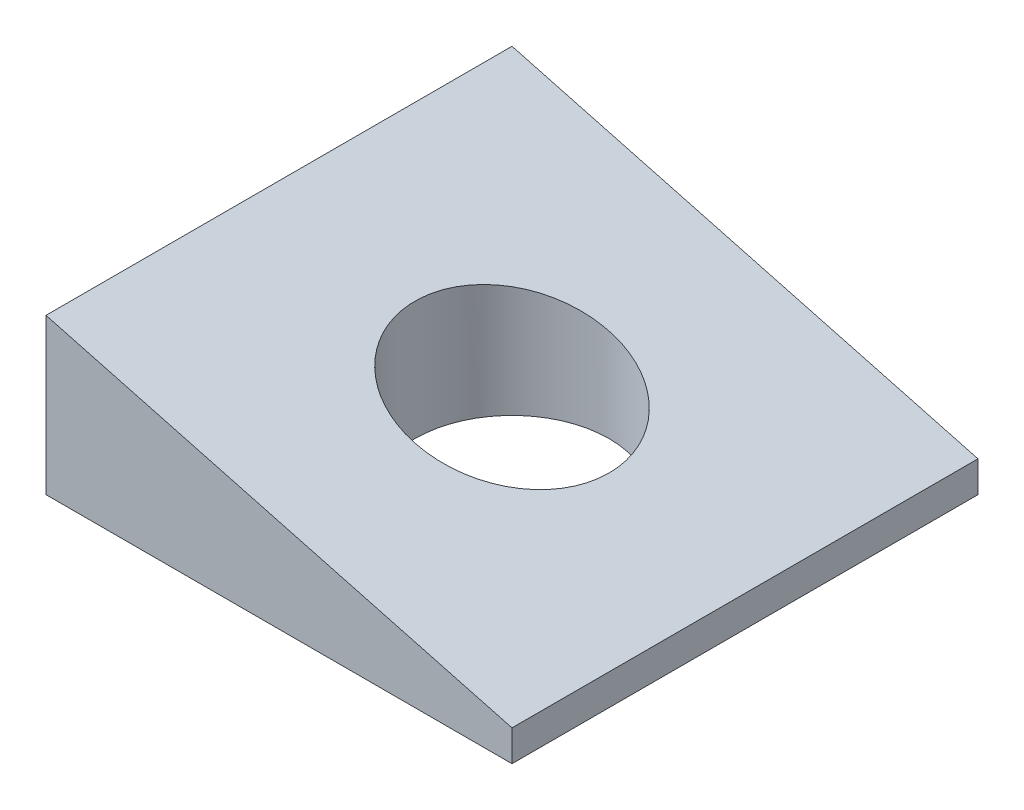
ISO-10303-21;
HEADER;
FILE_DESCRIPTION(('STEP AP214'),'2;1');
FILE_NAME('part.step','',(''),(''),'','','');
FILE_SCHEMA(('AUTOMOTIVE_DESIGN { 1 0 10303 214 1 1 1 1 }'));
ENDSEC;
DATA;
#1=APPLICATION_CONTEXT('core data for automotive mechanical design processes');
#2=APPLICATION_PROTOCOL_DEFINITION('international standard','automotive_design',2000,#1);
#3=PRODUCT_CONTEXT('',#1,'mechanical');
#4=PRODUCT('Part','Part','',(#3));
#5=PRODUCT_RELATED_PRODUCT_CATEGORY('part','',(#4));
#6=PRODUCT_DEFINITION_FORMATION('','',#4);
#7=PRODUCT_DEFINITION_CONTEXT('part definition',#1,'design');
#8=PRODUCT_DEFINITION('design','',#6,#7);
#9=PRODUCT_DEFINITION_SHAPE('','',#8);
#10=(LENGTH_UNIT() NAMED_UNIT(*) SI_UNIT(.MILLI.,.METRE.));
#11=(NAMED_UNIT(*) PLANE_ANGLE_UNIT() SI_UNIT($,.RADIAN.));
#12=(NAMED_UNIT(*) SI_UNIT($,.STERADIAN.) SOLID_ANGLE_UNIT());
#13=UNCERTAINTY_MEASURE_WITH_UNIT(LENGTH_MEASURE(1.E-05),#10,'distance_accuracy_value','');
#14=(GEOMETRIC_REPRESENTATION_CONTEXT(3) GLOBAL_UNCERTAINTY_ASSIGNED_CONTEXT((#13)) GLOBAL_UNIT_ASSIGNED_CONTEXT((#10,
#11,#12)) REPRESENTATION_CONTEXT('',''));
#15=CARTESIAN_POINT('',(0.,0.,0.));
#16=DIRECTION('',(0.,0.,1.));
#17=DIRECTION('',(1.,0.,0.));
#18=AXIS2_PLACEMENT_3D('',#15,#16,#17);
#19=CARTESIAN_POINT('',(38.1,0.,38.1));
#20=DIRECTION('',(0.,1.,0.));
#21=DIRECTION('',(-1.,0.,0.));
#22=AXIS2_PLACEMENT_3D('',#19,#20,#21);
#23=PLANE('',#22);
#24=CARTESIAN_POINT('',(19.05,0.,19.05));
#25=DIRECTION('',(0.,-1.,0.));
#26=DIRECTION('',(1.,0.,0.));
#27=AXIS2_PLACEMENT_3D('',#24,#25,#26);
#28=CIRCLE('',#27,7.9375);
#29=CARTESIAN_POINT('',(26.9875,0.,19.05));
#30=VERTEX_POINT('',#29);
#31=EDGE_CURVE('E159',#30,#30,#28,.T.);
#32=ORIENTED_EDGE('',*,*,#31,.F.);
#33=EDGE_LOOP('',(#32));
#34=FACE_BOUND('',#33,.T.);
#35=DIRECTION('',(1.,0.,0.));
#36=VECTOR('',#35,1.);
#37=CARTESIAN_POINT('',(38.1,0.,0.));
#38=LINE('',#37,#36);
#39=CARTESIAN_POINT('',(0.,0.,0.));
#40=VERTEX_POINT('',#39);
#41=CARTESIAN_POINT('',(38.1,0.,0.));
#42=VERTEX_POINT('',#41);
#43=EDGE_CURVE('E137',#40,#42,#38,.T.);
#44=ORIENTED_EDGE('',*,*,#43,.T.);
#45=DIRECTION('',(0.,0.,-1.));
#46=VECTOR('',#45,1.);
#47=CARTESIAN_POINT('',(38.1,0.,38.1));
#48=LINE('',#47,#46);
#49=CARTESIAN_POINT('',(38.1,0.,38.1));
#50=VERTEX_POINT('',#49);
#51=EDGE_CURVE('E13',#50,#42,#48,.T.);
#52=ORIENTED_EDGE('',*,*,#51,.F.);
#53=DIRECTION('',(1.,0.,0.));
#54=VECTOR('',#53,1.);
#55=CARTESIAN_POINT('',(38.1,0.,38.1));
#56=LINE('',#55,#54);
#57=CARTESIAN_POINT('',(0.,0.,38.1));
#58=VERTEX_POINT('',#57);
#59=EDGE_CURVE('E119',#58,#50,#56,.T.);
#60=ORIENTED_EDGE('',*,*,#59,.F.);
#61=DIRECTION('',(0.,0.,-1.));
#62=VECTOR('',#61,1.);
#63=CARTESIAN_POINT('',(0.,0.,38.1));
#64=LINE('',#63,#62);
#65=EDGE_CURVE('E133',#58,#40,#64,.T.);
#66=ORIENTED_EDGE('',*,*,#65,.T.);
#67=EDGE_LOOP('',(#44,#52,#60,#66));
#68=FACE_BOUND('',#67,.T.);
#69=ADVANCED_FACE('F58',(#34,#68),#23,.F.);
#70=CARTESIAN_POINT('',(38.1,2.54,38.1));
#71=DIRECTION('',(-1.,0.,0.));
#72=DIRECTION('',(0.,0.,1.));
#73=AXIS2_PLACEMENT_3D('',#70,#71,#72);
#74=PLANE('',#73);
#75=DIRECTION('',(0.,1.,0.));
#76=VECTOR('',#75,1.);
#77=CARTESIAN_POINT('',(38.1,2.54,0.));
#78=LINE('',#77,#76);
#79=CARTESIAN_POINT('',(38.1,2.54,0.));
#80=VERTEX_POINT('',#79);
#81=EDGE_CURVE('E124',#42,#80,#78,.T.);
#82=ORIENTED_EDGE('',*,*,#81,.T.);
#83=DIRECTION('',(0.,0.,-1.));
#84=VECTOR('',#83,1.);
#85=CARTESIAN_POINT('',(38.1,2.54,38.1));
#86=LINE('',#85,#84);
#87=CARTESIAN_POINT('',(38.1,2.54,38.1));
#88=VERTEX_POINT('',#87);
#89=EDGE_CURVE('E68',#88,#80,#86,.T.);
#90=ORIENTED_EDGE('',*,*,#89,.F.);
#91=DIRECTION('',(0.,1.,0.));
#92=VECTOR('',#91,1.);
#93=CARTESIAN_POINT('',(38.1,2.54,38.1));
#94=LINE('',#93,#92);
#95=EDGE_CURVE('E114',#50,#88,#94,.T.);
#96=ORIENTED_EDGE('',*,*,#95,.F.);
#97=ORIENTED_EDGE('',*,*,#51,.T.);
#98=EDGE_LOOP('',(#82,#90,#96,#97));
#99=FACE_BOUND('',#98,.T.);
#100=ADVANCED_FACE('F123',(#99),#74,.F.);
#101=CARTESIAN_POINT('',(0.,12.7,38.1));
#102=DIRECTION('',(-0.257662650560332,-0.966234939601246,0.));
#103=DIRECTION('',(0.966234939601247,-0.257662650560332,0.));
#104=AXIS2_PLACEMENT_3D('',#101,#102,#103);
#105=PLANE('',#104);
#106=CARTESIAN_POINT('',(19.05,7.62000000000001,19.05));
#107=DIRECTION('',(-0.257662650560332,-0.966234939601246,0.));
#108=DIRECTION('',(0.966234939601247,-0.257662650560332,0.));
#109=AXIS2_PLACEMENT_3D('',#106,#107,#108);
#110=ELLIPSE('',#109,8.21487577677093,7.9375);
#111=CARTESIAN_POINT('',(26.9875,5.50333333333334,19.05));
#112=VERTEX_POINT('',#111);
#113=EDGE_CURVE('E61',#112,#112,#110,.T.);
#114=ORIENTED_EDGE('',*,*,#113,.T.);
#115=EDGE_LOOP('',(#114));
#116=FACE_BOUND('',#115,.T.);
#117=DIRECTION('',(-0.966234939601246,0.257662650560332,0.));
#118=VECTOR('',#117,1.);
#119=CARTESIAN_POINT('',(0.,12.7,0.));
#120=LINE('',#119,#118);
#121=CARTESIAN_POINT('',(0.,12.7,0.));
#122=VERTEX_POINT('',#121);
#123=EDGE_CURVE('E100',#80,#122,#120,.T.);
#124=ORIENTED_EDGE('',*,*,#123,.T.);
#125=DIRECTION('',(0.,0.,-1.));
#126=VECTOR('',#125,1.);
#127=CARTESIAN_POINT('',(0.,12.7,38.1));
#128=LINE('',#127,#126);
#129=CARTESIAN_POINT('',(0.,12.7,38.1));
#130=VERTEX_POINT('',#129);
#131=EDGE_CURVE('E126',#130,#122,#128,.T.);
#132=ORIENTED_EDGE('',*,*,#131,.F.);
#133=DIRECTION('',(-0.966234939601246,0.257662650560332,0.));
#134=VECTOR('',#133,1.);
#135=CARTESIAN_POINT('',(0.,12.7,38.1));
#136=LINE('',#135,#134);
#137=EDGE_CURVE('E117',#88,#130,#136,.T.);
#138=ORIENTED_EDGE('',*,*,#137,.F.);
#139=ORIENTED_EDGE('',*,*,#89,.T.);
#140=EDGE_LOOP('',(#124,#132,#138,#139));
#141=FACE_BOUND('',#140,.T.);
#142=ADVANCED_FACE('F128',(#116,#141),#105,.F.);
#143=CARTESIAN_POINT('',(0.,0.,38.1));
#144=DIRECTION('',(1.,0.,0.));
#145=DIRECTION('',(0.,0.,-1.));
#146=AXIS2_PLACEMENT_3D('',#143,#144,#145);
#147=PLANE('',#146);
#148=DIRECTION('',(0.,-1.,0.));
#149=VECTOR('',#148,1.);
#150=CARTESIAN_POINT('',(0.,0.,0.));
#151=LINE('',#150,#149);
#152=EDGE_CURVE('E106',#122,#40,#151,.T.);
#153=ORIENTED_EDGE('',*,*,#152,.T.);
#154=ORIENTED_EDGE('',*,*,#65,.F.);
#155=DIRECTION('',(0.,-1.,0.));
#156=VECTOR('',#155,1.);
#157=CARTESIAN_POINT('',(0.,0.,38.1));
#158=LINE('',#157,#156);
#159=EDGE_CURVE('E79',#130,#58,#158,.T.);
#160=ORIENTED_EDGE('',*,*,#159,.F.);
#161=ORIENTED_EDGE('',*,*,#131,.T.);
#162=EDGE_LOOP('',(#153,#154,#160,#161));
#163=FACE_BOUND('',#162,.T.);
#164=ADVANCED_FACE('F151',(#163),#147,.F.);
#165=CARTESIAN_POINT('',(0.,0.,38.1));
#166=DIRECTION('',(0.,0.,-1.));
#167=DIRECTION('',(-1.,0.,0.));
#168=AXIS2_PLACEMENT_3D('',#165,#166,#167);
#169=PLANE('',#168);
#170=ORIENTED_EDGE('',*,*,#59,.T.);
#171=ORIENTED_EDGE('',*,*,#95,.T.);
#172=ORIENTED_EDGE('',*,*,#137,.T.);
#173=ORIENTED_EDGE('',*,*,#159,.T.);
#174=EDGE_LOOP('',(#170,#171,#172,#173));
#175=FACE_BOUND('',#174,.T.);
#176=ADVANCED_FACE('F115',(#175),#169,.F.);
#177=CARTESIAN_POINT('',(0.,0.,0.));
#178=DIRECTION('',(0.,0.,-1.));
#179=DIRECTION('',(-1.,0.,0.));
#180=AXIS2_PLACEMENT_3D('',#177,#178,#179);
#181=PLANE('',#180);
#182=ORIENTED_EDGE('',*,*,#43,.F.);
#183=ORIENTED_EDGE('',*,*,#152,.F.);
#184=ORIENTED_EDGE('',*,*,#123,.F.);
#185=ORIENTED_EDGE('',*,*,#81,.F.);
#186=EDGE_LOOP('',(#182,#183,#184,#185));
#187=FACE_BOUND('',#186,.T.);
#188=ADVANCED_FACE('F154',(#187),#181,.T.);
#189=CARTESIAN_POINT('',(19.05,38.1,19.05));
#190=DIRECTION('',(0.,-1.,0.));
#191=DIRECTION('',(1.,0.,0.));
#192=AXIS2_PLACEMENT_3D('',#189,#190,#191);
#193=CYLINDRICAL_SURFACE('',#192,7.9375);
#194=ORIENTED_EDGE('',*,*,#31,.T.);
#195=EDGE_LOOP('',(#194));
#196=FACE_BOUND('',#195,.T.);
#197=ORIENTED_EDGE('',*,*,#113,.F.);
#198=EDGE_LOOP('',(#197));
#199=FACE_BOUND('',#198,.T.);
#200=ADVANCED_FACE('F171',(#196,#199),#193,.F.);
#201=CLOSED_SHELL('',(#69,#100,#142,#164,#176,#188,#200));
#202=MANIFOLD_SOLID_BREP('B2',#201);
#203=ADVANCED_BREP_SHAPE_REPRESENTATION('',(#18,#202),#14);
#204=SHAPE_DEFINITION_REPRESENTATION(#9,#203);
ENDSEC;
END-ISO-10303-21;
